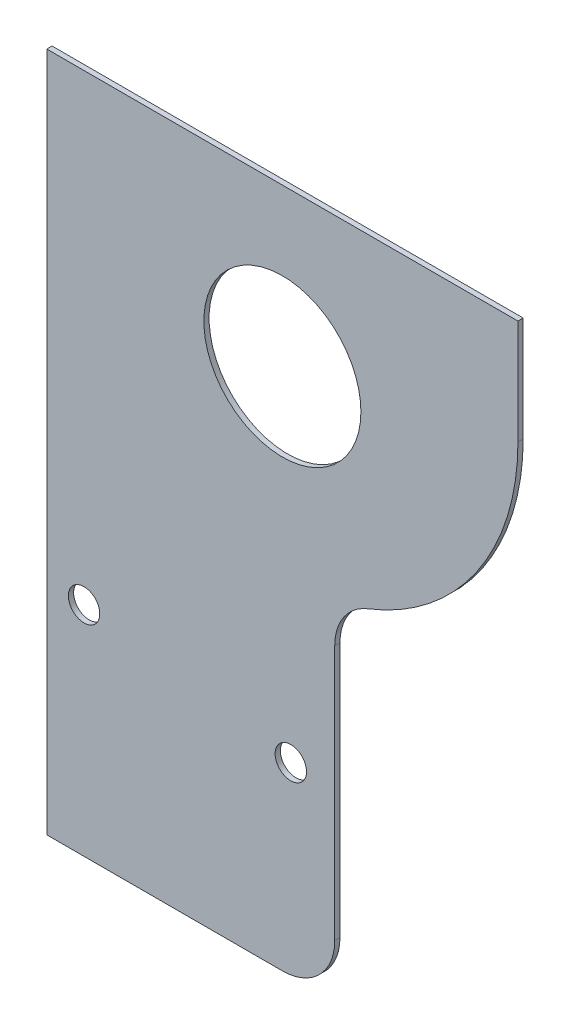
ISO-10303-21;
HEADER;
FILE_DESCRIPTION(('STEP AP214'),'2;1');
FILE_NAME('part.step','',(''),(''),'','','');
FILE_SCHEMA(('AUTOMOTIVE_DESIGN { 1 0 10303 214 1 1 1 1 }'));
ENDSEC;
DATA;
#1=APPLICATION_CONTEXT('core data for automotive mechanical design processes');
#2=APPLICATION_PROTOCOL_DEFINITION('international standard','automotive_design',2000,#1);
#3=PRODUCT_CONTEXT('',#1,'mechanical');
#4=PRODUCT('Part','Part','',(#3));
#5=PRODUCT_RELATED_PRODUCT_CATEGORY('part','',(#4));
#6=PRODUCT_DEFINITION_FORMATION('','',#4);
#7=PRODUCT_DEFINITION_CONTEXT('part definition',#1,'design');
#8=PRODUCT_DEFINITION('design','',#6,#7);
#9=PRODUCT_DEFINITION_SHAPE('','',#8);
#10=(LENGTH_UNIT() NAMED_UNIT(*) SI_UNIT(.MILLI.,.METRE.));
#11=(NAMED_UNIT(*) PLANE_ANGLE_UNIT() SI_UNIT($,.RADIAN.));
#12=(NAMED_UNIT(*) SI_UNIT($,.STERADIAN.) SOLID_ANGLE_UNIT());
#13=UNCERTAINTY_MEASURE_WITH_UNIT(LENGTH_MEASURE(1.E-05),#10,'distance_accuracy_value','');
#14=(GEOMETRIC_REPRESENTATION_CONTEXT(3) GLOBAL_UNCERTAINTY_ASSIGNED_CONTEXT((#13)) GLOBAL_UNIT_ASSIGNED_CONTEXT((#10,
#11,#12)) REPRESENTATION_CONTEXT('',''));
#15=CARTESIAN_POINT('',(0.,0.,0.));
#16=DIRECTION('',(0.,0.,1.));
#17=DIRECTION('',(1.,0.,0.));
#18=AXIS2_PLACEMENT_3D('',#15,#16,#17);
#19=CARTESIAN_POINT('',(45.,-130.,1.));
#20=DIRECTION('',(0.,-1.,0.));
#21=DIRECTION('',(0.,0.,-1.));
#22=AXIS2_PLACEMENT_3D('',#19,#20,#21);
#23=PLANE('',#22);
#24=DIRECTION('',(-1.,0.,0.));
#25=VECTOR('',#24,1.);
#26=CARTESIAN_POINT('',(45.,-130.,0.));
#27=LINE('',#26,#25);
#28=CARTESIAN_POINT('',(45.,-130.,0.));
#29=VERTEX_POINT('',#28);
#30=CARTESIAN_POINT('',(0.,-130.,0.));
#31=VERTEX_POINT('',#30);
#32=EDGE_CURVE('E146',#29,#31,#27,.T.);
#33=ORIENTED_EDGE('',*,*,#32,.F.);
#34=DIRECTION('',(0.,0.,-1.));
#35=VECTOR('',#34,1.);
#36=CARTESIAN_POINT('',(45.,-130.,1.));
#37=LINE('',#36,#35);
#38=CARTESIAN_POINT('',(45.,-130.,1.));
#39=VERTEX_POINT('',#38);
#40=EDGE_CURVE('E44',#39,#29,#37,.T.);
#41=ORIENTED_EDGE('',*,*,#40,.F.);
#42=DIRECTION('',(-1.,0.,0.));
#43=VECTOR('',#42,1.);
#44=CARTESIAN_POINT('',(45.,-130.,1.));
#45=LINE('',#44,#43);
#46=CARTESIAN_POINT('',(0.,-130.,1.));
#47=VERTEX_POINT('',#46);
#48=EDGE_CURVE('E119',#39,#47,#45,.T.);
#49=ORIENTED_EDGE('',*,*,#48,.T.);
#50=DIRECTION('',(0.,0.,-1.));
#51=VECTOR('',#50,1.);
#52=CARTESIAN_POINT('',(0.,-130.,1.));
#53=LINE('',#52,#51);
#54=EDGE_CURVE('E11',#47,#31,#53,.T.);
#55=ORIENTED_EDGE('',*,*,#54,.T.);
#56=EDGE_LOOP('',(#33,#41,#49,#55));
#57=FACE_BOUND('',#56,.T.);
#58=ADVANCED_FACE('F34',(#57),#23,.T.);
#59=CARTESIAN_POINT('',(45.,-120.,1.));
#60=DIRECTION('',(0.,0.,-1.));
#61=DIRECTION('',(-1.,0.,0.));
#62=AXIS2_PLACEMENT_3D('',#59,#60,#61);
#63=CYLINDRICAL_SURFACE('',#62,10.);
#64=CARTESIAN_POINT('',(45.,-120.,0.));
#65=DIRECTION('',(0.,0.,-1.));
#66=DIRECTION('',(-1.,0.,0.));
#67=AXIS2_PLACEMENT_3D('',#64,#65,#66);
#68=CIRCLE('',#67,10.);
#69=CARTESIAN_POINT('',(55.,-120.,0.));
#70=VERTEX_POINT('',#69);
#71=EDGE_CURVE('E105',#70,#29,#68,.T.);
#72=ORIENTED_EDGE('',*,*,#71,.F.);
#73=DIRECTION('',(0.,0.,-1.));
#74=VECTOR('',#73,1.);
#75=CARTESIAN_POINT('',(55.,-120.,1.));
#76=LINE('',#75,#74);
#77=CARTESIAN_POINT('',(55.,-120.,1.));
#78=VERTEX_POINT('',#77);
#79=EDGE_CURVE('E100',#78,#70,#76,.T.);
#80=ORIENTED_EDGE('',*,*,#79,.F.);
#81=CARTESIAN_POINT('',(45.,-120.,1.));
#82=DIRECTION('',(0.,0.,-1.));
#83=DIRECTION('',(-1.,0.,0.));
#84=AXIS2_PLACEMENT_3D('',#81,#82,#83);
#85=CIRCLE('',#84,10.);
#86=EDGE_CURVE('E103',#78,#39,#85,.T.);
#87=ORIENTED_EDGE('',*,*,#86,.T.);
#88=ORIENTED_EDGE('',*,*,#40,.T.);
#89=EDGE_LOOP('',(#72,#80,#87,#88));
#90=FACE_BOUND('',#89,.T.);
#91=ADVANCED_FACE('F102',(#90),#63,.T.);
#92=CARTESIAN_POINT('',(55.,-71.234753829798,1.));
#93=DIRECTION('',(1.,0.,0.));
#94=DIRECTION('',(0.,1.,0.));
#95=AXIS2_PLACEMENT_3D('',#92,#93,#94);
#96=PLANE('',#95);
#97=DIRECTION('',(0.,-1.,0.));
#98=VECTOR('',#97,1.);
#99=CARTESIAN_POINT('',(55.,-71.234753829798,0.));
#100=LINE('',#99,#98);
#101=CARTESIAN_POINT('',(55.,-71.234753829798,0.));
#102=VERTEX_POINT('',#101);
#103=EDGE_CURVE('E143',#102,#70,#100,.T.);
#104=ORIENTED_EDGE('',*,*,#103,.F.);
#105=DIRECTION('',(0.,0.,-1.));
#106=VECTOR('',#105,1.);
#107=CARTESIAN_POINT('',(55.,-71.234753829798,1.));
#108=LINE('',#107,#106);
#109=CARTESIAN_POINT('',(55.,-71.234753829798,1.));
#110=VERTEX_POINT('',#109);
#111=EDGE_CURVE('E110',#110,#102,#108,.T.);
#112=ORIENTED_EDGE('',*,*,#111,.F.);
#113=DIRECTION('',(0.,-1.,0.));
#114=VECTOR('',#113,1.);
#115=CARTESIAN_POINT('',(55.,-71.234753829798,1.));
#116=LINE('',#115,#114);
#117=EDGE_CURVE('E116',#110,#78,#116,.T.);
#118=ORIENTED_EDGE('',*,*,#117,.T.);
#119=ORIENTED_EDGE('',*,*,#79,.T.);
#120=EDGE_LOOP('',(#104,#112,#118,#119));
#121=FACE_BOUND('',#120,.T.);
#122=ADVANCED_FACE('F121',(#121),#96,.T.);
#123=CARTESIAN_POINT('',(65.,-71.234753829798,1.));
#124=DIRECTION('',(0.,0.,-1.));
#125=DIRECTION('',(-1.,0.,0.));
#126=AXIS2_PLACEMENT_3D('',#123,#124,#125);
#127=CYLINDRICAL_SURFACE('',#126,10.);
#128=CARTESIAN_POINT('',(65.,-71.234753829798,0.));
#129=DIRECTION('',(0.,0.,1.));
#130=DIRECTION('',(1.,0.,0.));
#131=AXIS2_PLACEMENT_3D('',#128,#129,#130);
#132=CIRCLE('',#131,10.);
#133=CARTESIAN_POINT('',(61.3636363636364,-61.919344042562,0.));
#134=VERTEX_POINT('',#133);
#135=EDGE_CURVE('E140',#134,#102,#132,.T.);
#136=ORIENTED_EDGE('',*,*,#135,.F.);
#137=DIRECTION('',(0.,0.,-1.));
#138=VECTOR('',#137,1.);
#139=CARTESIAN_POINT('',(61.3636363636364,-61.919344042562,1.));
#140=LINE('',#139,#138);
#141=CARTESIAN_POINT('',(61.3636363636364,-61.919344042562,1.));
#142=VERTEX_POINT('',#141);
#143=EDGE_CURVE('E151',#142,#134,#140,.T.);
#144=ORIENTED_EDGE('',*,*,#143,.F.);
#145=CARTESIAN_POINT('',(65.,-71.234753829798,1.));
#146=DIRECTION('',(0.,0.,1.));
#147=DIRECTION('',(1.,0.,0.));
#148=AXIS2_PLACEMENT_3D('',#145,#146,#147);
#149=CIRCLE('',#148,10.);
#150=EDGE_CURVE('E122',#142,#110,#149,.T.);
#151=ORIENTED_EDGE('',*,*,#150,.T.);
#152=ORIENTED_EDGE('',*,*,#111,.T.);
#153=EDGE_LOOP('',(#136,#144,#151,#152));
#154=FACE_BOUND('',#153,.T.);
#155=ADVANCED_FACE('F176',(#154),#127,.F.);
#156=CARTESIAN_POINT('',(45.,-20.,1.));
#157=DIRECTION('',(0.,0.,-1.));
#158=DIRECTION('',(-1.,0.,0.));
#159=AXIS2_PLACEMENT_3D('',#156,#157,#158);
#160=CYLINDRICAL_SURFACE('',#159,45.);
#161=CARTESIAN_POINT('',(45.,-20.,0.));
#162=DIRECTION('',(0.,0.,-1.));
#163=DIRECTION('',(-1.,0.,0.));
#164=AXIS2_PLACEMENT_3D('',#161,#162,#163);
#165=CIRCLE('',#164,45.);
#166=CARTESIAN_POINT('',(90.,-20.,0.));
#167=VERTEX_POINT('',#166);
#168=EDGE_CURVE('E137',#167,#134,#165,.T.);
#169=ORIENTED_EDGE('',*,*,#168,.F.);
#170=DIRECTION('',(0.,0.,-1.));
#171=VECTOR('',#170,1.);
#172=CARTESIAN_POINT('',(90.,-20.,1.));
#173=LINE('',#172,#171);
#174=CARTESIAN_POINT('',(90.,-20.,1.));
#175=VERTEX_POINT('',#174);
#176=EDGE_CURVE('E153',#175,#167,#173,.T.);
#177=ORIENTED_EDGE('',*,*,#176,.F.);
#178=CARTESIAN_POINT('',(45.,-20.,1.));
#179=DIRECTION('',(0.,0.,-1.));
#180=DIRECTION('',(-1.,0.,0.));
#181=AXIS2_PLACEMENT_3D('',#178,#179,#180);
#182=CIRCLE('',#181,45.);
#183=EDGE_CURVE('E124',#175,#142,#182,.T.);
#184=ORIENTED_EDGE('',*,*,#183,.T.);
#185=ORIENTED_EDGE('',*,*,#143,.T.);
#186=EDGE_LOOP('',(#169,#177,#184,#185));
#187=FACE_BOUND('',#186,.T.);
#188=ADVANCED_FACE('F179',(#187),#160,.T.);
#189=CARTESIAN_POINT('',(90.,0.,1.));
#190=DIRECTION('',(1.,0.,0.));
#191=DIRECTION('',(0.,0.,-1.));
#192=AXIS2_PLACEMENT_3D('',#189,#190,#191);
#193=PLANE('',#192);
#194=DIRECTION('',(0.,-1.,0.));
#195=VECTOR('',#194,1.);
#196=CARTESIAN_POINT('',(90.,0.,0.));
#197=LINE('',#196,#195);
#198=CARTESIAN_POINT('',(90.,0.,0.));
#199=VERTEX_POINT('',#198);
#200=EDGE_CURVE('E134',#199,#167,#197,.T.);
#201=ORIENTED_EDGE('',*,*,#200,.F.);
#202=DIRECTION('',(0.,0.,-1.));
#203=VECTOR('',#202,1.);
#204=CARTESIAN_POINT('',(90.,0.,1.));
#205=LINE('',#204,#203);
#206=CARTESIAN_POINT('',(90.,0.,1.));
#207=VERTEX_POINT('',#206);
#208=EDGE_CURVE('E154',#207,#199,#205,.T.);
#209=ORIENTED_EDGE('',*,*,#208,.F.);
#210=DIRECTION('',(0.,-1.,0.));
#211=VECTOR('',#210,1.);
#212=CARTESIAN_POINT('',(90.,0.,1.));
#213=LINE('',#212,#211);
#214=EDGE_CURVE('E235',#207,#175,#213,.T.);
#215=ORIENTED_EDGE('',*,*,#214,.T.);
#216=ORIENTED_EDGE('',*,*,#176,.T.);
#217=EDGE_LOOP('',(#201,#209,#215,#216));
#218=FACE_BOUND('',#217,.T.);
#219=ADVANCED_FACE('F183',(#218),#193,.T.);
#220=CARTESIAN_POINT('',(0.,0.,1.));
#221=DIRECTION('',(0.,1.,0.));
#222=DIRECTION('',(-1.,0.,0.));
#223=AXIS2_PLACEMENT_3D('',#220,#221,#222);
#224=PLANE('',#223);
#225=DIRECTION('',(1.,0.,0.));
#226=VECTOR('',#225,1.);
#227=CARTESIAN_POINT('',(0.,0.,0.));
#228=LINE('',#227,#226);
#229=CARTESIAN_POINT('',(0.,0.,0.));
#230=VERTEX_POINT('',#229);
#231=EDGE_CURVE('E130',#230,#199,#228,.T.);
#232=ORIENTED_EDGE('',*,*,#231,.F.);
#233=DIRECTION('',(0.,0.,-1.));
#234=VECTOR('',#233,1.);
#235=CARTESIAN_POINT('',(0.,0.,1.));
#236=LINE('',#235,#234);
#237=CARTESIAN_POINT('',(0.,0.,1.));
#238=VERTEX_POINT('',#237);
#239=EDGE_CURVE('E38',#238,#230,#236,.T.);
#240=ORIENTED_EDGE('',*,*,#239,.F.);
#241=DIRECTION('',(1.,0.,0.));
#242=VECTOR('',#241,1.);
#243=CARTESIAN_POINT('',(0.,0.,1.));
#244=LINE('',#243,#242);
#245=EDGE_CURVE('E233',#238,#207,#244,.T.);
#246=ORIENTED_EDGE('',*,*,#245,.T.);
#247=ORIENTED_EDGE('',*,*,#208,.T.);
#248=EDGE_LOOP('',(#232,#240,#246,#247));
#249=FACE_BOUND('',#248,.T.);
#250=ADVANCED_FACE('F160',(#249),#224,.T.);
#251=CARTESIAN_POINT('',(0.,-75.,1.));
#252=DIRECTION('',(-1.,0.,0.));
#253=DIRECTION('',(0.,-1.,0.));
#254=AXIS2_PLACEMENT_3D('',#251,#252,#253);
#255=PLANE('',#254);
#256=DIRECTION('',(0.,1.,0.));
#257=VECTOR('',#256,1.);
#258=CARTESIAN_POINT('',(0.,-75.,0.));
#259=LINE('',#258,#257);
#260=EDGE_CURVE('E83',#31,#230,#259,.T.);
#261=ORIENTED_EDGE('',*,*,#260,.F.);
#262=ORIENTED_EDGE('',*,*,#54,.F.);
#263=DIRECTION('',(0.,1.,0.));
#264=VECTOR('',#263,1.);
#265=CARTESIAN_POINT('',(0.,-130.,1.));
#266=LINE('',#265,#264);
#267=EDGE_CURVE('E86',#47,#238,#266,.T.);
#268=ORIENTED_EDGE('',*,*,#267,.T.);
#269=ORIENTED_EDGE('',*,*,#239,.T.);
#270=EDGE_LOOP('',(#261,#262,#268,#269));
#271=FACE_BOUND('',#270,.T.);
#272=ADVANCED_FACE('F36',(#271),#255,.T.);
#273=CARTESIAN_POINT('',(45.,-20.,1.));
#274=DIRECTION('',(0.,0.,-1.));
#275=DIRECTION('',(-1.,0.,0.));
#276=AXIS2_PLACEMENT_3D('',#273,#274,#275);
#277=PLANE('',#276);
#278=CARTESIAN_POINT('',(46.6082393500436,-94.757673425132,0.999999999999999));
#279=DIRECTION('',(0.,0.,-1.));
#280=DIRECTION('',(-1.,0.,0.));
#281=AXIS2_PLACEMENT_3D('',#278,#279,#280);
#282=CIRCLE('',#281,3.);
#283=CARTESIAN_POINT('',(43.6082393500436,-94.757673425132,0.999999999999999));
#284=VERTEX_POINT('',#283);
#285=EDGE_CURVE('E220',#284,#284,#282,.T.);
#286=ORIENTED_EDGE('',*,*,#285,.T.);
#287=EDGE_LOOP('',(#286));
#288=FACE_BOUND('',#287,.T.);
#289=CARTESIAN_POINT('',(7.11921200498831,-88.3845486545448,0.999999999999999));
#290=DIRECTION('',(0.,0.,-1.));
#291=DIRECTION('',(-1.,0.,0.));
#292=AXIS2_PLACEMENT_3D('',#289,#290,#291);
#293=CIRCLE('',#292,3.);
#294=CARTESIAN_POINT('',(4.11921200498831,-88.3845486545448,0.999999999999999));
#295=VERTEX_POINT('',#294);
#296=EDGE_CURVE('E222',#295,#295,#293,.T.);
#297=ORIENTED_EDGE('',*,*,#296,.T.);
#298=EDGE_LOOP('',(#297));
#299=FACE_BOUND('',#298,.T.);
#300=CARTESIAN_POINT('',(45.,-30.,1.));
#301=DIRECTION('',(0.,0.,-1.));
#302=DIRECTION('',(1.,0.,0.));
#303=AXIS2_PLACEMENT_3D('',#300,#301,#302);
#304=CIRCLE('',#303,15.);
#305=CARTESIAN_POINT('',(60.,-30.,1.));
#306=VERTEX_POINT('',#305);
#307=EDGE_CURVE('E131',#306,#306,#304,.T.);
#308=ORIENTED_EDGE('',*,*,#307,.T.);
#309=EDGE_LOOP('',(#308));
#310=FACE_BOUND('',#309,.T.);
#311=ORIENTED_EDGE('',*,*,#267,.F.);
#312=ORIENTED_EDGE('',*,*,#48,.F.);
#313=ORIENTED_EDGE('',*,*,#86,.F.);
#314=ORIENTED_EDGE('',*,*,#117,.F.);
#315=ORIENTED_EDGE('',*,*,#150,.F.);
#316=ORIENTED_EDGE('',*,*,#183,.F.);
#317=ORIENTED_EDGE('',*,*,#214,.F.);
#318=ORIENTED_EDGE('',*,*,#245,.F.);
#319=EDGE_LOOP('',(#311,#312,#313,#314,#315,#316,#317,#318));
#320=FACE_BOUND('',#319,.T.);
#321=ADVANCED_FACE('F114',(#288,#299,#310,#320),#277,.F.);
#322=CARTESIAN_POINT('',(45.,-20.,0.));
#323=DIRECTION('',(0.,0.,-1.));
#324=DIRECTION('',(-1.,0.,0.));
#325=AXIS2_PLACEMENT_3D('',#322,#323,#324);
#326=PLANE('',#325);
#327=CARTESIAN_POINT('',(46.6082393500436,-94.757673425132,0.));
#328=DIRECTION('',(0.,0.,-1.));
#329=DIRECTION('',(-1.,0.,0.));
#330=AXIS2_PLACEMENT_3D('',#327,#328,#329);
#331=CIRCLE('',#330,3.);
#332=CARTESIAN_POINT('',(43.6082393500436,-94.757673425132,0.));
#333=VERTEX_POINT('',#332);
#334=EDGE_CURVE('E218',#333,#333,#331,.T.);
#335=ORIENTED_EDGE('',*,*,#334,.F.);
#336=EDGE_LOOP('',(#335));
#337=FACE_BOUND('',#336,.T.);
#338=CARTESIAN_POINT('',(7.11921200498831,-88.3845486545448,0.));
#339=DIRECTION('',(0.,0.,-1.));
#340=DIRECTION('',(-1.,0.,0.));
#341=AXIS2_PLACEMENT_3D('',#338,#339,#340);
#342=CIRCLE('',#341,3.);
#343=CARTESIAN_POINT('',(4.11921200498831,-88.3845486545448,0.));
#344=VERTEX_POINT('',#343);
#345=EDGE_CURVE('E247',#344,#344,#342,.T.);
#346=ORIENTED_EDGE('',*,*,#345,.F.);
#347=EDGE_LOOP('',(#346));
#348=FACE_BOUND('',#347,.T.);
#349=CARTESIAN_POINT('',(45.,-30.,0.));
#350=DIRECTION('',(0.,0.,-1.));
#351=DIRECTION('',(1.,0.,0.));
#352=AXIS2_PLACEMENT_3D('',#349,#350,#351);
#353=CIRCLE('',#352,15.);
#354=CARTESIAN_POINT('',(60.,-30.,0.));
#355=VERTEX_POINT('',#354);
#356=EDGE_CURVE('E221',#355,#355,#353,.T.);
#357=ORIENTED_EDGE('',*,*,#356,.F.);
#358=EDGE_LOOP('',(#357));
#359=FACE_BOUND('',#358,.T.);
#360=ORIENTED_EDGE('',*,*,#32,.T.);
#361=ORIENTED_EDGE('',*,*,#260,.T.);
#362=ORIENTED_EDGE('',*,*,#231,.T.);
#363=ORIENTED_EDGE('',*,*,#200,.T.);
#364=ORIENTED_EDGE('',*,*,#168,.T.);
#365=ORIENTED_EDGE('',*,*,#135,.T.);
#366=ORIENTED_EDGE('',*,*,#103,.T.);
#367=ORIENTED_EDGE('',*,*,#71,.T.);
#368=EDGE_LOOP('',(#360,#361,#362,#363,#364,#365,#366,#367));
#369=FACE_BOUND('',#368,.T.);
#370=ADVANCED_FACE('F162',(#337,#348,#359,#369),#326,.T.);
#371=CARTESIAN_POINT('',(45.,-30.,1.));
#372=DIRECTION('',(0.,0.,-1.));
#373=DIRECTION('',(-1.,0.,0.));
#374=AXIS2_PLACEMENT_3D('',#371,#372,#373);
#375=CYLINDRICAL_SURFACE('',#374,15.);
#376=ORIENTED_EDGE('',*,*,#307,.F.);
#377=EDGE_LOOP('',(#376));
#378=FACE_BOUND('',#377,.T.);
#379=ORIENTED_EDGE('',*,*,#356,.T.);
#380=EDGE_LOOP('',(#379));
#381=FACE_BOUND('',#380,.T.);
#382=ADVANCED_FACE('F198',(#378,#381),#375,.F.);
#383=CARTESIAN_POINT('',(7.11921200498831,-88.3845486545448,10.));
#384=DIRECTION('',(0.,0.,-1.));
#385=DIRECTION('',(-1.,0.,0.));
#386=AXIS2_PLACEMENT_3D('',#383,#384,#385);
#387=CYLINDRICAL_SURFACE('',#386,3.);
#388=ORIENTED_EDGE('',*,*,#345,.T.);
#389=EDGE_LOOP('',(#388));
#390=FACE_BOUND('',#389,.T.);
#391=ORIENTED_EDGE('',*,*,#296,.F.);
#392=EDGE_LOOP('',(#391));
#393=FACE_BOUND('',#392,.T.);
#394=ADVANCED_FACE('F205',(#390,#393),#387,.F.);
#395=CARTESIAN_POINT('',(46.6082393500436,-94.757673425132,10.));
#396=DIRECTION('',(0.,0.,-1.));
#397=DIRECTION('',(-1.,0.,0.));
#398=AXIS2_PLACEMENT_3D('',#395,#396,#397);
#399=CYLINDRICAL_SURFACE('',#398,3.);
#400=ORIENTED_EDGE('',*,*,#334,.T.);
#401=EDGE_LOOP('',(#400));
#402=FACE_BOUND('',#401,.T.);
#403=ORIENTED_EDGE('',*,*,#285,.F.);
#404=EDGE_LOOP('',(#403));
#405=FACE_BOUND('',#404,.T.);
#406=ADVANCED_FACE('F209',(#402,#405),#399,.F.);
#407=CLOSED_SHELL('',(#58,#91,#122,#155,#188,#219,#250,#272,#321,#370,#382,#394,#406));
#408=MANIFOLD_SOLID_BREP('B2',#407);
#409=ADVANCED_BREP_SHAPE_REPRESENTATION('',(#18,#408),#14);
#410=SHAPE_DEFINITION_REPRESENTATION(#9,#409);
ENDSEC;
END-ISO-10303-21;
